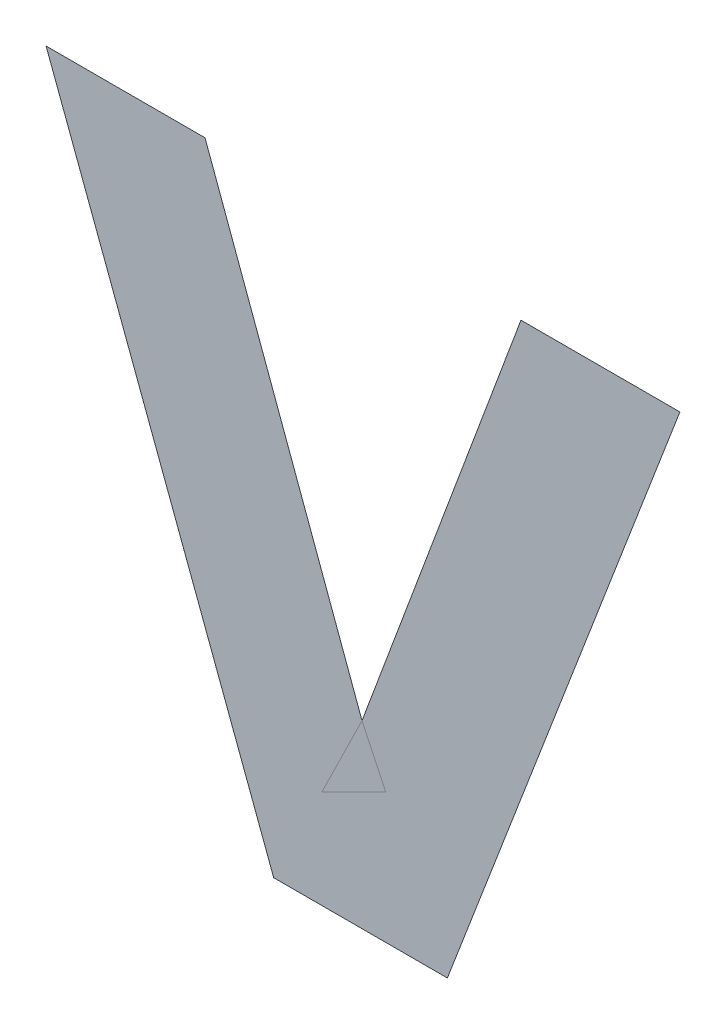
ISO-10303-21;
HEADER;
FILE_DESCRIPTION(('STEP AP214'),'2;1');
FILE_NAME('part.step','',(''),(''),'','','');
FILE_SCHEMA(('AUTOMOTIVE_DESIGN { 1 0 10303 214 1 1 1 1 }'));
ENDSEC;
DATA;
#1=APPLICATION_CONTEXT('core data for automotive mechanical design processes');
#2=APPLICATION_PROTOCOL_DEFINITION('international standard','automotive_design',2000,#1);
#3=PRODUCT_CONTEXT('',#1,'mechanical');
#4=PRODUCT('Part','Part','',(#3));
#5=PRODUCT_RELATED_PRODUCT_CATEGORY('part','',(#4));
#6=PRODUCT_DEFINITION_FORMATION('','',#4);
#7=PRODUCT_DEFINITION_CONTEXT('part definition',#1,'design');
#8=PRODUCT_DEFINITION('design','',#6,#7);
#9=PRODUCT_DEFINITION_SHAPE('','',#8);
#10=(LENGTH_UNIT() NAMED_UNIT(*) SI_UNIT(.MILLI.,.METRE.));
#11=(NAMED_UNIT(*) PLANE_ANGLE_UNIT() SI_UNIT($,.RADIAN.));
#12=(NAMED_UNIT(*) SI_UNIT($,.STERADIAN.) SOLID_ANGLE_UNIT());
#13=UNCERTAINTY_MEASURE_WITH_UNIT(LENGTH_MEASURE(1.E-05),#10,'distance_accuracy_value','');
#14=(GEOMETRIC_REPRESENTATION_CONTEXT(3) GLOBAL_UNCERTAINTY_ASSIGNED_CONTEXT((#13)) GLOBAL_UNIT_ASSIGNED_CONTEXT((#10,
#11,#12)) REPRESENTATION_CONTEXT('',''));
#15=CARTESIAN_POINT('',(0.,0.,0.));
#16=DIRECTION('',(0.,0.,1.));
#17=DIRECTION('',(1.,0.,0.));
#18=AXIS2_PLACEMENT_3D('',#15,#16,#17);
#19=CARTESIAN_POINT('',(-0.103580435857,0.899692190159,0.00015));
#20=DIRECTION('',(0.,0.,1.));
#21=DIRECTION('',(1.,0.,0.));
#22=AXIS2_PLACEMENT_3D('',#19,#20,#21);
#23=PLANE('',#22);
#24=CARTESIAN_POINT('',(-0.110422420099,0.92595557828,0.00015));
#25=DIRECTION('',(-1.,0.,0.));
#26=VECTOR('',#25,1.);
#27=LINE('',#24,#26);
#28=CARTESIAN_POINT('',(-0.110422420099,0.92595557828,7.5E-05));
#29=VERTEX_POINT('',#28);
#30=CARTESIAN_POINT('',(-0.117304361716,0.92595557828,7.5E-05));
#31=VERTEX_POINT('',#30);
#32=EDGE_CURVE('E127',#29,#31,#27,.T.);
#33=ORIENTED_EDGE('',*,*,#32,.T.);
#34=CARTESIAN_POINT('',(-0.117304361716,0.92595557828,0.00015));
#35=DIRECTION('',(0.351380067446934,-0.936232902754965,0.));
#36=VECTOR('',#35,1.);
#37=LINE('',#34,#36);
#38=CARTESIAN_POINT('',(-0.107447379482,0.899692190159,7.5E-05));
#39=VERTEX_POINT('',#38);
#40=EDGE_CURVE('E28',#31,#39,#37,.T.);
#41=ORIENTED_EDGE('',*,*,#40,.T.);
#42=CARTESIAN_POINT('',(-0.107447379482,0.899692190159,0.00015));
#43=DIRECTION('',(1.,0.,0.));
#44=VECTOR('',#43,1.);
#45=LINE('',#42,#44);
#46=CARTESIAN_POINT('',(-0.099927495699,0.899692190159,7.5E-05));
#47=VERTEX_POINT('',#46);
#48=EDGE_CURVE('E11',#39,#47,#45,.T.);
#49=ORIENTED_EDGE('',*,*,#48,.T.);
#50=CARTESIAN_POINT('',(-0.099927495699,0.899692190159,0.00015));
#51=DIRECTION('',(0.358039959944758,0.933706263812531,0.));
#52=VECTOR('',#51,1.);
#53=LINE('',#50,#52);
#54=CARTESIAN_POINT('',(-0.089856509999,0.92595557828,7.5E-05));
#55=VERTEX_POINT('',#54);
#56=EDGE_CURVE('E53',#47,#55,#53,.T.);
#57=ORIENTED_EDGE('',*,*,#56,.T.);
#58=CARTESIAN_POINT('',(-0.089856509999,0.92595557828,0.00015));
#59=DIRECTION('',(-1.,0.,0.));
#60=VECTOR('',#59,1.);
#61=LINE('',#58,#60);
#62=CARTESIAN_POINT('',(-0.09674048361565,0.92595557828,7.5E-05));
#63=VERTEX_POINT('',#62);
#64=EDGE_CURVE('E50',#55,#63,#61,.T.);
#65=ORIENTED_EDGE('',*,*,#64,.T.);
#66=CARTESIAN_POINT('',(-0.09674048361565,0.92595557828,0.00015));
#67=DIRECTION('',(-0.347456646242414,-0.937696048291756,0.));
#68=VECTOR('',#67,1.);
#69=LINE('',#66,#68);
#70=CARTESIAN_POINT('',(-0.103623440174,0.907494477069,7.5E-05));
#71=VERTEX_POINT('',#70);
#72=EDGE_CURVE('E125',#63,#71,#69,.T.);
#73=ORIENTED_EDGE('',*,*,#72,.T.);
#74=CARTESIAN_POINT('',(-0.103665766099,0.907494477069,0.00015));
#75=DIRECTION('',(-0.343697840041297,0.93908029196174,0.));
#76=VECTOR('',#75,1.);
#77=LINE('',#74,#76);
#78=EDGE_CURVE('E126',#71,#29,#77,.T.);
#79=ORIENTED_EDGE('',*,*,#78,.T.);
#80=EDGE_LOOP('',(#33,#41,#49,#57,#65,#73,#79));
#81=FACE_BOUND('',#80,.T.);
#82=ADVANCED_FACE('F17',(#81),#23,.T.);
#83=CARTESIAN_POINT('',(-0.103580435857,0.899692190159,0.));
#84=DIRECTION('',(0.,0.,1.));
#85=DIRECTION('',(1.,0.,0.));
#86=AXIS2_PLACEMENT_3D('',#83,#84,#85);
#87=PLANE('',#86);
#88=ORIENTED_EDGE('',*,*,#40,.F.);
#89=ORIENTED_EDGE('',*,*,#32,.F.);
#90=ORIENTED_EDGE('',*,*,#78,.F.);
#91=ORIENTED_EDGE('',*,*,#72,.F.);
#92=ORIENTED_EDGE('',*,*,#64,.F.);
#93=ORIENTED_EDGE('',*,*,#56,.F.);
#94=ORIENTED_EDGE('',*,*,#48,.F.);
#95=EDGE_LOOP('',(#88,#89,#90,#91,#92,#93,#94));
#96=FACE_BOUND('',#95,.T.);
#97=ADVANCED_FACE('F55',(#96),#87,.F.);
#98=CLOSED_SHELL('',(#82,#97));
#99=MANIFOLD_SOLID_BREP('B1',#98);
#100=ADVANCED_BREP_SHAPE_REPRESENTATION('',(#18,#99),#14);
#101=SHAPE_DEFINITION_REPRESENTATION(#9,#100);
ENDSEC;
END-ISO-10303-21;
